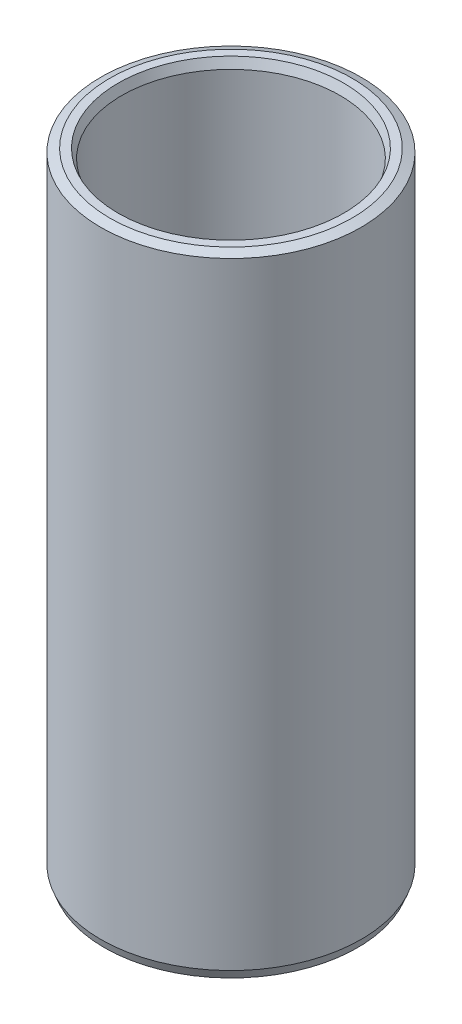
ISO-10303-21;
HEADER;
FILE_DESCRIPTION(('STEP AP214'),'2;1');
FILE_NAME('part.step','',(''),(''),'','','');
FILE_SCHEMA(('AUTOMOTIVE_DESIGN { 1 0 10303 214 1 1 1 1 }'));
ENDSEC;
DATA;
#1=APPLICATION_CONTEXT('core data for automotive mechanical design processes');
#2=APPLICATION_PROTOCOL_DEFINITION('international standard','automotive_design',2000,#1);
#3=PRODUCT_CONTEXT('',#1,'mechanical');
#4=PRODUCT('Part','Part','',(#3));
#5=PRODUCT_RELATED_PRODUCT_CATEGORY('part','',(#4));
#6=PRODUCT_DEFINITION_FORMATION('','',#4);
#7=PRODUCT_DEFINITION_CONTEXT('part definition',#1,'design');
#8=PRODUCT_DEFINITION('design','',#6,#7);
#9=PRODUCT_DEFINITION_SHAPE('','',#8);
#10=(LENGTH_UNIT() NAMED_UNIT(*) SI_UNIT(.MILLI.,.METRE.));
#11=(NAMED_UNIT(*) PLANE_ANGLE_UNIT() SI_UNIT($,.RADIAN.));
#12=(NAMED_UNIT(*) SI_UNIT($,.STERADIAN.) SOLID_ANGLE_UNIT());
#13=UNCERTAINTY_MEASURE_WITH_UNIT(LENGTH_MEASURE(1.E-05),#10,'distance_accuracy_value','');
#14=(GEOMETRIC_REPRESENTATION_CONTEXT(3) GLOBAL_UNCERTAINTY_ASSIGNED_CONTEXT((#13)) GLOBAL_UNIT_ASSIGNED_CONTEXT((#10,
#11,#12)) REPRESENTATION_CONTEXT('',''));
#15=CARTESIAN_POINT('',(0.,0.,0.));
#16=DIRECTION('',(0.,0.,1.));
#17=DIRECTION('',(1.,0.,0.));
#18=AXIS2_PLACEMENT_3D('',#15,#16,#17);
#19=CARTESIAN_POINT('',(0.,265.875630394377,0.));
#20=DIRECTION('',(0.,-1.,0.));
#21=DIRECTION('',(0.,0.,-1.));
#22=AXIS2_PLACEMENT_3D('',#19,#20,#21);
#23=CYLINDRICAL_SURFACE('',#22,55.);
#24=CARTESIAN_POINT('',(0.,3.79060208810228,0.));
#25=DIRECTION('',(0.,1.,0.));
#26=DIRECTION('',(0.,0.,1.));
#27=AXIS2_PLACEMENT_3D('',#24,#25,#26);
#28=CIRCLE('',#27,55.);
#29=CARTESIAN_POINT('',(0.,3.79060208810228,55.));
#30=VERTEX_POINT('',#29);
#31=EDGE_CURVE('E10',#30,#30,#28,.T.);
#32=ORIENTED_EDGE('',*,*,#31,.T.);
#33=EDGE_LOOP('',(#32));
#34=FACE_BOUND('',#33,.T.);
#35=CARTESIAN_POINT('',(0.,264.36854668122,0.));
#36=DIRECTION('',(0.,1.,0.));
#37=DIRECTION('',(0.,0.,1.));
#38=AXIS2_PLACEMENT_3D('',#35,#36,#37);
#39=CIRCLE('',#38,55.);
#40=CARTESIAN_POINT('',(0.,264.36854668122,55.));
#41=VERTEX_POINT('',#40);
#42=EDGE_CURVE('E50',#41,#41,#39,.F.);
#43=ORIENTED_EDGE('',*,*,#42,.T.);
#44=EDGE_LOOP('',(#43));
#45=FACE_BOUND('',#44,.T.);
#46=ADVANCED_FACE('F39',(#34,#45),#23,.T.);
#47=CARTESIAN_POINT('',(0.,265.875630394377,0.));
#48=DIRECTION('',(0.,1.,0.));
#49=DIRECTION('',(0.,0.,1.));
#50=AXIS2_PLACEMENT_3D('',#47,#48,#49);
#51=PLANE('',#50);
#52=CARTESIAN_POINT('',(0.,265.875630394377,0.));
#53=DIRECTION('',(0.,1.,0.));
#54=DIRECTION('',(0.,0.,1.));
#55=AXIS2_PLACEMENT_3D('',#52,#53,#54);
#56=CIRCLE('',#55,47.6578861733002);
#57=CARTESIAN_POINT('',(0.,265.875630394377,47.6578861733002));
#58=VERTEX_POINT('',#57);
#59=EDGE_CURVE('E58',#58,#58,#56,.F.);
#60=ORIENTED_EDGE('',*,*,#59,.T.);
#61=EDGE_LOOP('',(#60));
#62=FACE_BOUND('',#61,.T.);
#63=CARTESIAN_POINT('',(0.,265.875630394377,0.));
#64=DIRECTION('',(0.,1.,0.));
#65=DIRECTION('',(0.,0.,1.));
#66=AXIS2_PLACEMENT_3D('',#63,#64,#65);
#67=CIRCLE('',#66,51.2093979118974);
#68=CARTESIAN_POINT('',(0.,265.875630394377,51.2093979118974));
#69=VERTEX_POINT('',#68);
#70=EDGE_CURVE('E61',#69,#69,#67,.T.);
#71=ORIENTED_EDGE('',*,*,#70,.T.);
#72=EDGE_LOOP('',(#71));
#73=FACE_BOUND('',#72,.T.);
#74=ADVANCED_FACE('F88',(#62,#73),#51,.T.);
#75=CARTESIAN_POINT('',(0.,0.,0.));
#76=DIRECTION('',(0.,1.,0.));
#77=DIRECTION('',(0.,0.,1.));
#78=AXIS2_PLACEMENT_3D('',#75,#76,#77);
#79=PLANE('',#78);
#80=CARTESIAN_POINT('',(0.,0.,0.));
#81=DIRECTION('',(0.,1.,0.));
#82=DIRECTION('',(0.,0.,1.));
#83=AXIS2_PLACEMENT_3D('',#80,#81,#82);
#84=CIRCLE('',#83,49.9414045482459);
#85=CARTESIAN_POINT('',(0.,0.,49.9414045482459));
#86=VERTEX_POINT('',#85);
#87=EDGE_CURVE('E51',#86,#86,#84,.T.);
#88=ORIENTED_EDGE('',*,*,#87,.T.);
#89=EDGE_LOOP('',(#88));
#90=FACE_BOUND('',#89,.T.);
#91=CARTESIAN_POINT('',(0.,0.,0.));
#92=DIRECTION('',(0.,1.,0.));
#93=DIRECTION('',(0.,0.,1.));
#94=AXIS2_PLACEMENT_3D('',#91,#92,#93);
#95=CIRCLE('',#94,53.4929162868433);
#96=CARTESIAN_POINT('',(0.,0.,53.4929162868433));
#97=VERTEX_POINT('',#96);
#98=EDGE_CURVE('E54',#97,#97,#95,.F.);
#99=ORIENTED_EDGE('',*,*,#98,.T.);
#100=EDGE_LOOP('',(#99));
#101=FACE_BOUND('',#100,.T.);
#102=ADVANCED_FACE('F83',(#90,#101),#79,.F.);
#103=CARTESIAN_POINT('',(0.,265.875630394377,0.));
#104=DIRECTION('',(0.,-1.,0.));
#105=DIRECTION('',(0.,0.,-1.));
#106=AXIS2_PLACEMENT_3D('',#103,#104,#105);
#107=CYLINDRICAL_SURFACE('',#106,46.1508024601433);
#108=CARTESIAN_POINT('',(0.,262.085028306274,0.));
#109=DIRECTION('',(0.,1.,0.));
#110=DIRECTION('',(0.,0.,1.));
#111=AXIS2_PLACEMENT_3D('',#108,#109,#110);
#112=CIRCLE('',#111,46.1508024601433);
#113=CARTESIAN_POINT('',(0.,262.085028306274,46.1508024601433));
#114=VERTEX_POINT('',#113);
#115=EDGE_CURVE('E67',#114,#114,#112,.T.);
#116=ORIENTED_EDGE('',*,*,#115,.T.);
#117=EDGE_LOOP('',(#116));
#118=FACE_BOUND('',#117,.T.);
#119=CARTESIAN_POINT('',(0.,1.50708371315683,0.));
#120=DIRECTION('',(0.,1.,0.));
#121=DIRECTION('',(0.,0.,1.));
#122=AXIS2_PLACEMENT_3D('',#119,#120,#121);
#123=CIRCLE('',#122,46.1508024601433);
#124=CARTESIAN_POINT('',(0.,1.50708371315683,46.1508024601433));
#125=VERTEX_POINT('',#124);
#126=EDGE_CURVE('E69',#125,#125,#123,.F.);
#127=ORIENTED_EDGE('',*,*,#126,.T.);
#128=EDGE_LOOP('',(#127));
#129=FACE_BOUND('',#128,.T.);
#130=ADVANCED_FACE('F71',(#118,#129),#107,.F.);
#131=CARTESIAN_POINT('',(0.,262.085028306274,0.));
#132=DIRECTION('',(0.,1.,0.));
#133=DIRECTION('',(0.,0.,1.));
#134=AXIS2_PLACEMENT_3D('',#131,#132,#133);
#135=CONICAL_SURFACE('',#134,46.1508024601433,0.378422106461024);
#136=ORIENTED_EDGE('',*,*,#59,.F.);
#137=EDGE_LOOP('',(#136));
#138=FACE_BOUND('',#137,.T.);
#139=ORIENTED_EDGE('',*,*,#115,.F.);
#140=EDGE_LOOP('',(#139));
#141=FACE_BOUND('',#140,.T.);
#142=ADVANCED_FACE('F77',(#138,#141),#135,.F.);
#143=CARTESIAN_POINT('',(0.,0.,0.));
#144=DIRECTION('',(0.,-1.,0.));
#145=DIRECTION('',(0.,0.,-1.));
#146=AXIS2_PLACEMENT_3D('',#143,#144,#145);
#147=CONICAL_SURFACE('',#146,49.9414045482459,1.19237422033387);
#148=ORIENTED_EDGE('',*,*,#126,.F.);
#149=EDGE_LOOP('',(#148));
#150=FACE_BOUND('',#149,.T.);
#151=ORIENTED_EDGE('',*,*,#87,.F.);
#152=EDGE_LOOP('',(#151));
#153=FACE_BOUND('',#152,.T.);
#154=ADVANCED_FACE('F73',(#150,#153),#147,.F.);
#155=CARTESIAN_POINT('',(0.,3.79060208810228,0.));
#156=DIRECTION('',(0.,1.,0.));
#157=DIRECTION('',(0.,0.,1.));
#158=AXIS2_PLACEMENT_3D('',#155,#156,#157);
#159=CONICAL_SURFACE('',#158,55.,0.378422106461025);
#160=ORIENTED_EDGE('',*,*,#98,.F.);
#161=EDGE_LOOP('',(#160));
#162=FACE_BOUND('',#161,.T.);
#163=ORIENTED_EDGE('',*,*,#31,.F.);
#164=EDGE_LOOP('',(#163));
#165=FACE_BOUND('',#164,.T.);
#166=ADVANCED_FACE('F76',(#162,#165),#159,.T.);
#167=CARTESIAN_POINT('',(0.,265.875630394377,0.));
#168=DIRECTION('',(0.,-1.,0.));
#169=DIRECTION('',(0.,0.,-1.));
#170=AXIS2_PLACEMENT_3D('',#167,#168,#169);
#171=CONICAL_SURFACE('',#170,51.2093979118974,1.19237422033388);
#172=ORIENTED_EDGE('',*,*,#42,.F.);
#173=EDGE_LOOP('',(#172));
#174=FACE_BOUND('',#173,.T.);
#175=ORIENTED_EDGE('',*,*,#70,.F.);
#176=EDGE_LOOP('',(#175));
#177=FACE_BOUND('',#176,.T.);
#178=ADVANCED_FACE('F45',(#174,#177),#171,.T.);
#179=CLOSED_SHELL('',(#46,#74,#102,#130,#142,#154,#166,#178));
#180=MANIFOLD_SOLID_BREP('B2',#179);
#181=ADVANCED_BREP_SHAPE_REPRESENTATION('',(#18,#180),#14);
#182=SHAPE_DEFINITION_REPRESENTATION(#9,#181);
ENDSEC;
END-ISO-10303-21;
